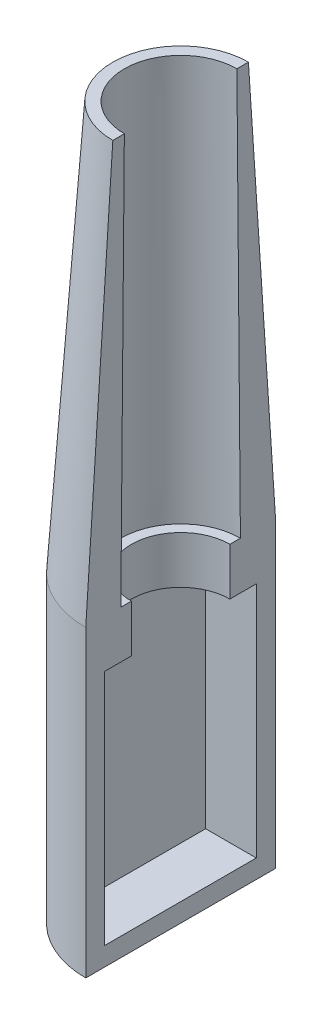
ISO-10303-21;
HEADER;
FILE_DESCRIPTION(('STEP AP214'),'2;1');
FILE_NAME('part.step','',(''),(''),'','','');
FILE_SCHEMA(('AUTOMOTIVE_DESIGN { 1 0 10303 214 1 1 1 1 }'));
ENDSEC;
DATA;
#1=APPLICATION_CONTEXT('core data for automotive mechanical design processes');
#2=APPLICATION_PROTOCOL_DEFINITION('international standard','automotive_design',2000,#1);
#3=PRODUCT_CONTEXT('',#1,'mechanical');
#4=PRODUCT('Part','Part','',(#3));
#5=PRODUCT_RELATED_PRODUCT_CATEGORY('part','',(#4));
#6=PRODUCT_DEFINITION_FORMATION('','',#4);
#7=PRODUCT_DEFINITION_CONTEXT('part definition',#1,'design');
#8=PRODUCT_DEFINITION('design','',#6,#7);
#9=PRODUCT_DEFINITION_SHAPE('','',#8);
#10=(LENGTH_UNIT() NAMED_UNIT(*) SI_UNIT(.MILLI.,.METRE.));
#11=(NAMED_UNIT(*) PLANE_ANGLE_UNIT() SI_UNIT($,.RADIAN.));
#12=(NAMED_UNIT(*) SI_UNIT($,.STERADIAN.) SOLID_ANGLE_UNIT());
#13=UNCERTAINTY_MEASURE_WITH_UNIT(LENGTH_MEASURE(1.E-05),#10,'distance_accuracy_value','');
#14=(GEOMETRIC_REPRESENTATION_CONTEXT(3) GLOBAL_UNCERTAINTY_ASSIGNED_CONTEXT((#13)) GLOBAL_UNIT_ASSIGNED_CONTEXT((#10,
#11,#12)) REPRESENTATION_CONTEXT('',''));
#15=CARTESIAN_POINT('',(0.,0.,0.));
#16=DIRECTION('',(0.,0.,1.));
#17=DIRECTION('',(1.,0.,0.));
#18=AXIS2_PLACEMENT_3D('',#15,#16,#17);
#19=CARTESIAN_POINT('',(0.,-17.79,-25.4));
#20=DIRECTION('',(-1.,0.,0.));
#21=DIRECTION('',(0.,0.,1.));
#22=AXIS2_PLACEMENT_3D('',#19,#20,#21);
#23=PLANE('',#22);
#24=DIRECTION('',(0.,0.,1.));
#25=VECTOR('',#24,1.);
#26=CARTESIAN_POINT('',(0.,50.7917616328513,20.3928994448823));
#27=LINE('',#26,#25);
#28=CARTESIAN_POINT('',(0.,50.7917616328513,13.1822284974348));
#29=VERTEX_POINT('',#28);
#30=CARTESIAN_POINT('',(0.,50.7917616328513,20.3928994448823));
#31=VERTEX_POINT('',#30);
#32=EDGE_CURVE('E137',#29,#31,#27,.T.);
#33=ORIENTED_EDGE('',*,*,#32,.F.);
#34=DIRECTION('',(0.,1.,0.));
#35=VECTOR('',#34,1.);
#36=CARTESIAN_POINT('',(0.,49.9404640000001,13.1822284974348));
#37=LINE('',#36,#35);
#38=CARTESIAN_POINT('',(0.,63.5,13.1822284974348));
#39=VERTEX_POINT('',#38);
#40=EDGE_CURVE('E56',#29,#39,#37,.T.);
#41=ORIENTED_EDGE('',*,*,#40,.T.);
#42=DIRECTION('',(0.,0.,1.));
#43=VECTOR('',#42,1.);
#44=CARTESIAN_POINT('',(0.,63.5,0.));
#45=LINE('',#44,#43);
#46=CARTESIAN_POINT('',(0.,63.5,16.008353463869));
#47=VERTEX_POINT('',#46);
#48=EDGE_CURVE('E134',#39,#47,#45,.T.);
#49=ORIENTED_EDGE('',*,*,#48,.T.);
#50=DIRECTION('',(0.,0.999963047796073,-0.00859668787320367));
#51=VECTOR('',#50,1.);
#52=CARTESIAN_POINT('',(0.,1925.58481173595,0.));
#53=LINE('',#52,#51);
#54=CARTESIAN_POINT('',(0.,172.817536,15.06855));
#55=VERTEX_POINT('',#54);
#56=EDGE_CURVE('E166',#55,#47,#53,.F.);
#57=ORIENTED_EDGE('',*,*,#56,.F.);
#58=DIRECTION('',(0.,0.,1.));
#59=VECTOR('',#58,1.);
#60=CARTESIAN_POINT('',(0.,172.817536,0.));
#61=LINE('',#60,#59);
#62=CARTESIAN_POINT('',(0.,172.817536,18.1533949257193));
#63=VERTEX_POINT('',#62);
#64=EDGE_CURVE('E146',#55,#63,#61,.T.);
#65=ORIENTED_EDGE('',*,*,#64,.T.);
#66=DIRECTION('',(0.,0.997810065711136,-0.0661443328301023));
#67=VECTOR('',#66,1.);
#68=CARTESIAN_POINT('',(0.,446.66775730677,0.));
#69=LINE('',#68,#67);
#70=CARTESIAN_POINT('',(0.,63.5,25.4));
#71=VERTEX_POINT('',#70);
#72=EDGE_CURVE('E172',#71,#63,#69,.T.);
#73=ORIENTED_EDGE('',*,*,#72,.F.);
#74=DIRECTION('',(0.,1.,0.));
#75=VECTOR('',#74,1.);
#76=CARTESIAN_POINT('',(0.,-17.78,25.4));
#77=LINE('',#76,#75);
#78=CARTESIAN_POINT('',(0.,-17.78,25.4));
#79=VERTEX_POINT('',#78);
#80=EDGE_CURVE('E161',#71,#79,#77,.F.);
#81=ORIENTED_EDGE('',*,*,#80,.T.);
#82=DIRECTION('',(0.,0.,1.));
#83=VECTOR('',#82,1.);
#84=CARTESIAN_POINT('',(0.,-17.78,0.));
#85=LINE('',#84,#83);
#86=CARTESIAN_POINT('',(0.,-17.78,-25.4));
#87=VERTEX_POINT('',#86);
#88=EDGE_CURVE('E165',#87,#79,#85,.T.);
#89=ORIENTED_EDGE('',*,*,#88,.F.);
#90=DIRECTION('',(0.,1.,0.));
#91=VECTOR('',#90,1.);
#92=CARTESIAN_POINT('',(0.,-17.78,-25.4));
#93=LINE('',#92,#91);
#94=CARTESIAN_POINT('',(0.,63.5,-25.4));
#95=VERTEX_POINT('',#94);
#96=EDGE_CURVE('E157',#87,#95,#93,.T.);
#97=ORIENTED_EDGE('',*,*,#96,.T.);
#98=DIRECTION('',(0.,-0.997810065711136,-0.0661443328301023));
#99=VECTOR('',#98,1.);
#100=CARTESIAN_POINT('',(0.,446.66775730677,0.));
#101=LINE('',#100,#99);
#102=CARTESIAN_POINT('',(0.,172.817536,-18.1533949257193));
#103=VERTEX_POINT('',#102);
#104=EDGE_CURVE('E175',#103,#95,#101,.T.);
#105=ORIENTED_EDGE('',*,*,#104,.F.);
#106=CARTESIAN_POINT('',(0.,172.817536,-15.06855));
#107=VERTEX_POINT('',#106);
#108=EDGE_CURVE('E151',#103,#107,#61,.T.);
#109=ORIENTED_EDGE('',*,*,#108,.T.);
#110=DIRECTION('',(0.,-0.999963047796073,-0.00859668787320367));
#111=VECTOR('',#110,1.);
#112=CARTESIAN_POINT('',(0.,1925.58481173595,0.));
#113=LINE('',#112,#111);
#114=CARTESIAN_POINT('',(0.,63.5,-16.008353463869));
#115=VERTEX_POINT('',#114);
#116=EDGE_CURVE('E169',#115,#107,#113,.F.);
#117=ORIENTED_EDGE('',*,*,#116,.F.);
#118=CARTESIAN_POINT('',(0.,63.5,-13.1822284974348));
#119=VERTEX_POINT('',#118);
#120=EDGE_CURVE('E49',#115,#119,#45,.T.);
#121=ORIENTED_EDGE('',*,*,#120,.T.);
#122=DIRECTION('',(0.,1.,0.));
#123=VECTOR('',#122,1.);
#124=CARTESIAN_POINT('',(0.,49.9404640000001,-13.1822284974348));
#125=LINE('',#124,#123);
#126=CARTESIAN_POINT('',(0.,50.7917616328513,-13.1822284974348));
#127=VERTEX_POINT('',#126);
#128=EDGE_CURVE('E125',#119,#127,#125,.F.);
#129=ORIENTED_EDGE('',*,*,#128,.T.);
#130=CARTESIAN_POINT('',(0.,50.7917616328513,-20.2524777503594));
#131=VERTEX_POINT('',#130);
#132=EDGE_CURVE('E220',#131,#127,#27,.T.);
#133=ORIENTED_EDGE('',*,*,#132,.F.);
#134=DIRECTION('',(0.,1.,0.));
#135=VECTOR('',#134,1.);
#136=CARTESIAN_POINT('',(0.,50.7917616328513,-20.2524777503594));
#137=LINE('',#136,#135);
#138=CARTESIAN_POINT('',(0.,-12.7767699099195,-20.2524777503594));
#139=VERTEX_POINT('',#138);
#140=EDGE_CURVE('E224',#139,#131,#137,.T.);
#141=ORIENTED_EDGE('',*,*,#140,.F.);
#142=DIRECTION('',(0.,0.,-1.));
#143=VECTOR('',#142,1.);
#144=CARTESIAN_POINT('',(0.,-12.7767699099195,-20.2524777503594));
#145=LINE('',#144,#143);
#146=CARTESIAN_POINT('',(0.,-12.7767699099195,20.3928994448823));
#147=VERTEX_POINT('',#146);
#148=EDGE_CURVE('E139',#147,#139,#145,.T.);
#149=ORIENTED_EDGE('',*,*,#148,.F.);
#150=DIRECTION('',(0.,-1.,0.));
#151=VECTOR('',#150,1.);
#152=CARTESIAN_POINT('',(0.,0.,20.3928994448823));
#153=LINE('',#152,#151);
#154=EDGE_CURVE('E216',#31,#147,#153,.T.);
#155=ORIENTED_EDGE('',*,*,#154,.F.);
#156=EDGE_LOOP('',(#33,#41,#49,#57,#65,#73,#81,#89,#97,#105,#109,#117,#121,#129,#133,#141,#149,#155));
#157=FACE_BOUND('',#156,.T.);
#158=ADVANCED_FACE('F41',(#157),#23,.F.);
#159=CARTESIAN_POINT('',(0.,-17.78,0.));
#160=DIRECTION('',(0.,1.,0.));
#161=DIRECTION('',(0.,0.,1.));
#162=AXIS2_PLACEMENT_3D('',#159,#160,#161);
#163=CYLINDRICAL_SURFACE('',#162,25.4);
#164=ORIENTED_EDGE('',*,*,#80,.F.);
#165=CARTESIAN_POINT('',(0.,63.5,0.));
#166=DIRECTION('',(0.,1.,0.));
#167=DIRECTION('',(0.,0.,1.));
#168=AXIS2_PLACEMENT_3D('',#165,#166,#167);
#169=CIRCLE('',#168,25.4);
#170=EDGE_CURVE('E189',#95,#71,#169,.T.);
#171=ORIENTED_EDGE('',*,*,#170,.F.);
#172=ORIENTED_EDGE('',*,*,#96,.F.);
#173=CARTESIAN_POINT('',(0.,-17.78,0.));
#174=DIRECTION('',(0.,1.,0.));
#175=DIRECTION('',(0.,0.,1.));
#176=AXIS2_PLACEMENT_3D('',#173,#174,#175);
#177=CIRCLE('',#176,25.4);
#178=EDGE_CURVE('E154',#87,#79,#177,.T.);
#179=ORIENTED_EDGE('',*,*,#178,.T.);
#180=EDGE_LOOP('',(#164,#171,#172,#179));
#181=FACE_BOUND('',#180,.T.);
#182=ADVANCED_FACE('F187',(#181),#163,.T.);
#183=CARTESIAN_POINT('',(0.,-17.78,0.));
#184=DIRECTION('',(0.,1.,0.));
#185=DIRECTION('',(0.,0.,1.));
#186=AXIS2_PLACEMENT_3D('',#183,#184,#185);
#187=PLANE('',#186);
#188=ORIENTED_EDGE('',*,*,#178,.F.);
#189=ORIENTED_EDGE('',*,*,#88,.T.);
#190=EDGE_LOOP('',(#188,#189));
#191=FACE_BOUND('',#190,.T.);
#192=ADVANCED_FACE('F180',(#191),#187,.F.);
#193=CARTESIAN_POINT('',(0.,63.5,0.));
#194=DIRECTION('',(0.,-1.,0.));
#195=DIRECTION('',(0.,0.,1.));
#196=AXIS2_PLACEMENT_3D('',#193,#194,#195);
#197=CONICAL_SURFACE('',#196,25.4,0.0661926590794363);
#198=CARTESIAN_POINT('',(0.,172.817536,0.));
#199=DIRECTION('',(0.,1.,0.));
#200=DIRECTION('',(0.,0.,1.));
#201=AXIS2_PLACEMENT_3D('',#198,#199,#200);
#202=CIRCLE('',#201,18.1533949257193);
#203=EDGE_CURVE('E191',#103,#63,#202,.T.);
#204=ORIENTED_EDGE('',*,*,#203,.F.);
#205=ORIENTED_EDGE('',*,*,#104,.T.);
#206=ORIENTED_EDGE('',*,*,#170,.T.);
#207=ORIENTED_EDGE('',*,*,#72,.T.);
#208=EDGE_LOOP('',(#204,#205,#206,#207));
#209=FACE_BOUND('',#208,.T.);
#210=ADVANCED_FACE('F289',(#209),#197,.T.);
#211=CARTESIAN_POINT('',(0.,172.817536,0.));
#212=DIRECTION('',(0.,1.,0.));
#213=DIRECTION('',(0.,0.,1.));
#214=AXIS2_PLACEMENT_3D('',#211,#212,#213);
#215=PLANE('',#214);
#216=ORIENTED_EDGE('',*,*,#108,.F.);
#217=ORIENTED_EDGE('',*,*,#203,.T.);
#218=ORIENTED_EDGE('',*,*,#64,.F.);
#219=CARTESIAN_POINT('',(0.,172.817536,0.));
#220=DIRECTION('',(0.,1.,0.));
#221=DIRECTION('',(0.,0.,1.));
#222=AXIS2_PLACEMENT_3D('',#219,#220,#221);
#223=CIRCLE('',#222,15.06855);
#224=EDGE_CURVE('E199',#107,#55,#223,.T.);
#225=ORIENTED_EDGE('',*,*,#224,.F.);
#226=EDGE_LOOP('',(#216,#217,#218,#225));
#227=FACE_BOUND('',#226,.T.);
#228=ADVANCED_FACE('F296',(#227),#215,.T.);
#229=CARTESIAN_POINT('',(0.,172.817536,0.));
#230=DIRECTION('',(0.,-1.,0.));
#231=DIRECTION('',(0.,0.,1.));
#232=AXIS2_PLACEMENT_3D('',#229,#230,#231);
#233=CONICAL_SURFACE('',#232,15.06855,0.00859679376362329);
#234=CARTESIAN_POINT('',(0.,63.5,0.));
#235=DIRECTION('',(0.,1.,0.));
#236=DIRECTION('',(0.,0.,1.));
#237=AXIS2_PLACEMENT_3D('',#234,#235,#236);
#238=CIRCLE('',#237,16.008353463869);
#239=EDGE_CURVE('E144',#115,#47,#238,.T.);
#240=ORIENTED_EDGE('',*,*,#239,.F.);
#241=ORIENTED_EDGE('',*,*,#116,.T.);
#242=ORIENTED_EDGE('',*,*,#224,.T.);
#243=ORIENTED_EDGE('',*,*,#56,.T.);
#244=EDGE_LOOP('',(#240,#241,#242,#243));
#245=FACE_BOUND('',#244,.T.);
#246=ADVANCED_FACE('F269',(#245),#233,.F.);
#247=CARTESIAN_POINT('',(0.,63.5,0.));
#248=DIRECTION('',(0.,1.,0.));
#249=DIRECTION('',(0.,0.,1.));
#250=AXIS2_PLACEMENT_3D('',#247,#248,#249);
#251=PLANE('',#250);
#252=CARTESIAN_POINT('',(0.,63.5,0.));
#253=DIRECTION('',(0.,1.,0.));
#254=DIRECTION('',(0.,0.,1.));
#255=AXIS2_PLACEMENT_3D('',#252,#253,#254);
#256=CIRCLE('',#255,13.1822284974348);
#257=EDGE_CURVE('E122',#119,#39,#256,.T.);
#258=ORIENTED_EDGE('',*,*,#257,.F.);
#259=ORIENTED_EDGE('',*,*,#120,.F.);
#260=ORIENTED_EDGE('',*,*,#239,.T.);
#261=ORIENTED_EDGE('',*,*,#48,.F.);
#262=EDGE_LOOP('',(#258,#259,#260,#261));
#263=FACE_BOUND('',#262,.T.);
#264=ADVANCED_FACE('F142',(#263),#251,.T.);
#265=CARTESIAN_POINT('',(-13.5595359999999,0.,20.3928994448823));
#266=DIRECTION('',(0.,0.,1.));
#267=DIRECTION('',(1.,0.,0.));
#268=AXIS2_PLACEMENT_3D('',#265,#266,#267);
#269=PLANE('',#268);
#270=ORIENTED_EDGE('',*,*,#154,.T.);
#271=DIRECTION('',(1.,0.,0.));
#272=VECTOR('',#271,1.);
#273=CARTESIAN_POINT('',(-13.5595359999999,-12.7767699099195,20.3928994448823));
#274=LINE('',#273,#272);
#275=CARTESIAN_POINT('',(-13.5595359999999,-12.7767699099195,20.3928994448823));
#276=VERTEX_POINT('',#275);
#277=EDGE_CURVE('E63',#276,#147,#274,.T.);
#278=ORIENTED_EDGE('',*,*,#277,.F.);
#279=DIRECTION('',(0.,-1.,0.));
#280=VECTOR('',#279,1.);
#281=CARTESIAN_POINT('',(-13.5595359999999,-12.7767699099195,20.3928994448823));
#282=LINE('',#281,#280);
#283=CARTESIAN_POINT('',(-13.5595359999999,50.7917616328513,20.3928994448823));
#284=VERTEX_POINT('',#283);
#285=EDGE_CURVE('E219',#284,#276,#282,.T.);
#286=ORIENTED_EDGE('',*,*,#285,.F.);
#287=DIRECTION('',(1.,0.,0.));
#288=VECTOR('',#287,1.);
#289=CARTESIAN_POINT('',(-13.5595359999999,50.7917616328513,20.3928994448823));
#290=LINE('',#289,#288);
#291=EDGE_CURVE('E203',#284,#31,#290,.T.);
#292=ORIENTED_EDGE('',*,*,#291,.T.);
#293=EDGE_LOOP('',(#270,#278,#286,#292));
#294=FACE_BOUND('',#293,.T.);
#295=ADVANCED_FACE('F260',(#294),#269,.F.);
#296=CARTESIAN_POINT('',(-13.5595359999999,50.7917616328513,20.3928994448823));
#297=DIRECTION('',(0.,1.,0.));
#298=DIRECTION('',(0.,0.,1.));
#299=AXIS2_PLACEMENT_3D('',#296,#297,#298);
#300=PLANE('',#299);
#301=ORIENTED_EDGE('',*,*,#132,.T.);
#302=CARTESIAN_POINT('',(0.,50.7917616328513,0.));
#303=DIRECTION('',(0.,1.,0.));
#304=DIRECTION('',(0.,0.,1.));
#305=AXIS2_PLACEMENT_3D('',#302,#303,#304);
#306=CIRCLE('',#305,13.1822284974348);
#307=EDGE_CURVE('E11',#127,#29,#306,.T.);
#308=ORIENTED_EDGE('',*,*,#307,.T.);
#309=ORIENTED_EDGE('',*,*,#32,.T.);
#310=ORIENTED_EDGE('',*,*,#291,.F.);
#311=DIRECTION('',(0.,0.,1.));
#312=VECTOR('',#311,1.);
#313=CARTESIAN_POINT('',(-13.5595359999999,50.7917616328513,20.3928994448823));
#314=LINE('',#313,#312);
#315=CARTESIAN_POINT('',(-13.5595359999999,50.7917616328513,-20.2524777503594));
#316=VERTEX_POINT('',#315);
#317=EDGE_CURVE('E207',#316,#284,#314,.T.);
#318=ORIENTED_EDGE('',*,*,#317,.F.);
#319=DIRECTION('',(1.,0.,0.));
#320=VECTOR('',#319,1.);
#321=CARTESIAN_POINT('',(-13.5595359999999,50.7917616328513,-20.2524777503594));
#322=LINE('',#321,#320);
#323=EDGE_CURVE('E210',#316,#131,#322,.T.);
#324=ORIENTED_EDGE('',*,*,#323,.T.);
#325=EDGE_LOOP('',(#301,#308,#309,#310,#318,#324));
#326=FACE_BOUND('',#325,.T.);
#327=ADVANCED_FACE('F249',(#326),#300,.F.);
#328=CARTESIAN_POINT('',(-13.5595359999999,50.7917616328513,-20.2524777503594));
#329=DIRECTION('',(0.,0.,-1.));
#330=DIRECTION('',(-1.,0.,0.));
#331=AXIS2_PLACEMENT_3D('',#328,#329,#330);
#332=PLANE('',#331);
#333=ORIENTED_EDGE('',*,*,#140,.T.);
#334=ORIENTED_EDGE('',*,*,#323,.F.);
#335=DIRECTION('',(0.,1.,0.));
#336=VECTOR('',#335,1.);
#337=CARTESIAN_POINT('',(-13.5595359999999,50.7917616328513,-20.2524777503594));
#338=LINE('',#337,#336);
#339=CARTESIAN_POINT('',(-13.5595359999999,-12.7767699099195,-20.2524777503594));
#340=VERTEX_POINT('',#339);
#341=EDGE_CURVE('E233',#340,#316,#338,.T.);
#342=ORIENTED_EDGE('',*,*,#341,.F.);
#343=DIRECTION('',(1.,0.,0.));
#344=VECTOR('',#343,1.);
#345=CARTESIAN_POINT('',(-13.5595359999999,-12.7767699099195,-20.2524777503594));
#346=LINE('',#345,#344);
#347=EDGE_CURVE('E206',#340,#139,#346,.T.);
#348=ORIENTED_EDGE('',*,*,#347,.T.);
#349=EDGE_LOOP('',(#333,#334,#342,#348));
#350=FACE_BOUND('',#349,.T.);
#351=ADVANCED_FACE('F254',(#350),#332,.F.);
#352=CARTESIAN_POINT('',(-13.5595359999999,-12.7767699099195,-20.2524777503594));
#353=DIRECTION('',(0.,-1.,0.));
#354=DIRECTION('',(0.,0.,-1.));
#355=AXIS2_PLACEMENT_3D('',#352,#353,#354);
#356=PLANE('',#355);
#357=ORIENTED_EDGE('',*,*,#148,.T.);
#358=ORIENTED_EDGE('',*,*,#347,.F.);
#359=DIRECTION('',(0.,0.,-1.));
#360=VECTOR('',#359,1.);
#361=CARTESIAN_POINT('',(-13.5595359999999,-12.7767699099195,-20.2524777503594));
#362=LINE('',#361,#360);
#363=EDGE_CURVE('E237',#276,#340,#362,.T.);
#364=ORIENTED_EDGE('',*,*,#363,.F.);
#365=ORIENTED_EDGE('',*,*,#277,.T.);
#366=EDGE_LOOP('',(#357,#358,#364,#365));
#367=FACE_BOUND('',#366,.T.);
#368=ADVANCED_FACE('F256',(#367),#356,.F.);
#369=CARTESIAN_POINT('',(-13.5595359999999,0.,0.));
#370=DIRECTION('',(-1.,0.,0.));
#371=DIRECTION('',(0.,0.,1.));
#372=AXIS2_PLACEMENT_3D('',#369,#370,#371);
#373=PLANE('',#372);
#374=ORIENTED_EDGE('',*,*,#285,.T.);
#375=ORIENTED_EDGE('',*,*,#363,.T.);
#376=ORIENTED_EDGE('',*,*,#341,.T.);
#377=ORIENTED_EDGE('',*,*,#317,.T.);
#378=EDGE_LOOP('',(#374,#375,#376,#377));
#379=FACE_BOUND('',#378,.T.);
#380=ADVANCED_FACE('F258',(#379),#373,.F.);
#381=CARTESIAN_POINT('',(0.,49.9404640000001,0.));
#382=DIRECTION('',(0.,1.,0.));
#383=DIRECTION('',(0.,0.,1.));
#384=AXIS2_PLACEMENT_3D('',#381,#382,#383);
#385=CYLINDRICAL_SURFACE('',#384,13.1822284974348);
#386=ORIENTED_EDGE('',*,*,#307,.F.);
#387=ORIENTED_EDGE('',*,*,#128,.F.);
#388=ORIENTED_EDGE('',*,*,#257,.T.);
#389=ORIENTED_EDGE('',*,*,#40,.F.);
#390=EDGE_LOOP('',(#386,#387,#388,#389));
#391=FACE_BOUND('',#390,.T.);
#392=ADVANCED_FACE('F123',(#391),#385,.F.);
#393=CLOSED_SHELL('',(#158,#182,#192,#210,#228,#246,#264,#295,#327,#351,#368,#380,#392));
#394=MANIFOLD_SOLID_BREP('B2',#393);
#395=ADVANCED_BREP_SHAPE_REPRESENTATION('',(#18,#394),#14);
#396=SHAPE_DEFINITION_REPRESENTATION(#9,#395);
ENDSEC;
END-ISO-10303-21;
